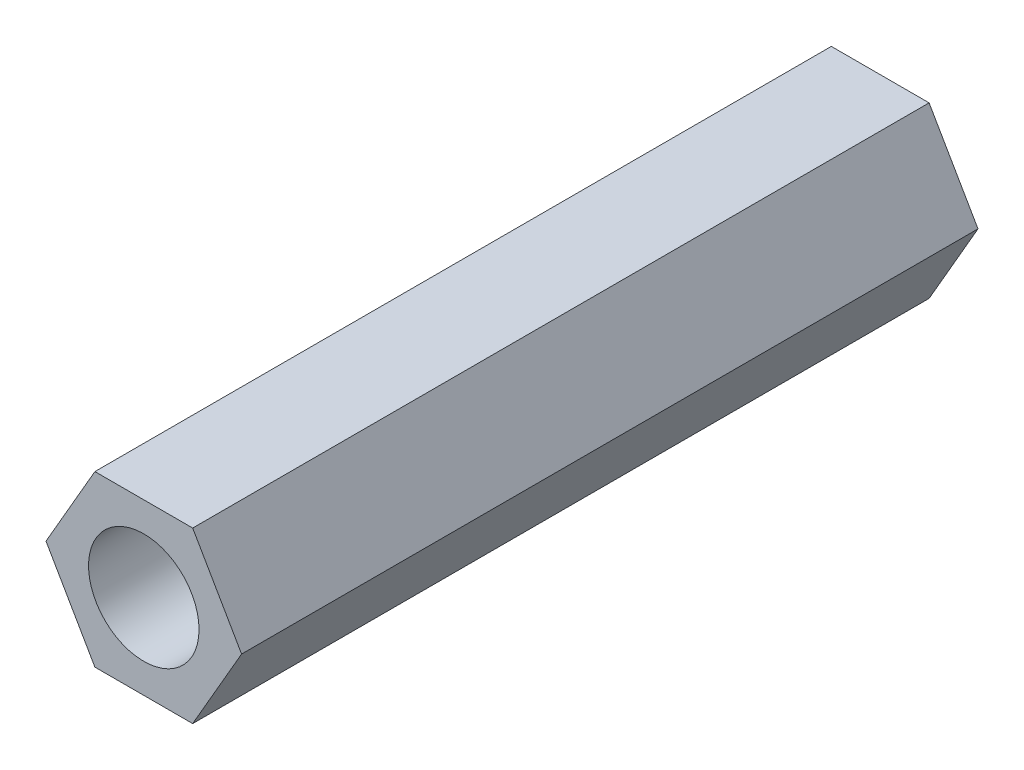
ISO-10303-21;
HEADER;
FILE_DESCRIPTION(('STEP AP214'),'2;1');
FILE_NAME('part.step','',(''),(''),'','','');
FILE_SCHEMA(('AUTOMOTIVE_DESIGN { 1 0 10303 214 1 1 1 1 }'));
ENDSEC;
DATA;
#1=APPLICATION_CONTEXT('core data for automotive mechanical design processes');
#2=APPLICATION_PROTOCOL_DEFINITION('international standard','automotive_design',2000,#1);
#3=PRODUCT_CONTEXT('',#1,'mechanical');
#4=PRODUCT('Part','Part','',(#3));
#5=PRODUCT_RELATED_PRODUCT_CATEGORY('part','',(#4));
#6=PRODUCT_DEFINITION_FORMATION('','',#4);
#7=PRODUCT_DEFINITION_CONTEXT('part definition',#1,'design');
#8=PRODUCT_DEFINITION('design','',#6,#7);
#9=PRODUCT_DEFINITION_SHAPE('','',#8);
#10=(LENGTH_UNIT() NAMED_UNIT(*) SI_UNIT(.MILLI.,.METRE.));
#11=(NAMED_UNIT(*) PLANE_ANGLE_UNIT() SI_UNIT($,.RADIAN.));
#12=(NAMED_UNIT(*) SI_UNIT($,.STERADIAN.) SOLID_ANGLE_UNIT());
#13=UNCERTAINTY_MEASURE_WITH_UNIT(LENGTH_MEASURE(1.E-05),#10,'distance_accuracy_value','');
#14=(GEOMETRIC_REPRESENTATION_CONTEXT(3) GLOBAL_UNCERTAINTY_ASSIGNED_CONTEXT((#13)) GLOBAL_UNIT_ASSIGNED_CONTEXT((#10,
#11,#12)) REPRESENTATION_CONTEXT('',''));
#15=CARTESIAN_POINT('',(0.,0.,0.));
#16=DIRECTION('',(0.,0.,1.));
#17=DIRECTION('',(1.,0.,0.));
#18=AXIS2_PLACEMENT_3D('',#15,#16,#17);
#19=CARTESIAN_POINT('',(0.,0.,20.));
#20=DIRECTION('',(0.,0.,1.));
#21=DIRECTION('',(1.,0.,0.));
#22=AXIS2_PLACEMENT_3D('',#19,#20,#21);
#23=PLANE('',#22);
#24=DIRECTION('',(0.5,0.866025403784439,0.));
#25=VECTOR('',#24,1.);
#26=CARTESIAN_POINT('',(1.32790561913614,-2.3,20.));
#27=LINE('',#26,#25);
#28=CARTESIAN_POINT('',(1.32790561913614,-2.3,20.));
#29=VERTEX_POINT('',#28);
#30=CARTESIAN_POINT('',(2.65581123827228,0.,20.));
#31=VERTEX_POINT('',#30);
#32=EDGE_CURVE('E146',#29,#31,#27,.T.);
#33=ORIENTED_EDGE('',*,*,#32,.T.);
#34=DIRECTION('',(-0.5,0.866025403784439,0.));
#35=VECTOR('',#34,1.);
#36=CARTESIAN_POINT('',(2.65581123827228,0.,20.));
#37=LINE('',#36,#35);
#38=CARTESIAN_POINT('',(1.32790561913614,2.3,20.));
#39=VERTEX_POINT('',#38);
#40=EDGE_CURVE('E94',#31,#39,#37,.T.);
#41=ORIENTED_EDGE('',*,*,#40,.T.);
#42=DIRECTION('',(-1.,0.,0.));
#43=VECTOR('',#42,1.);
#44=CARTESIAN_POINT('',(1.32790561913614,2.3,20.));
#45=LINE('',#44,#43);
#46=CARTESIAN_POINT('',(-1.32790561913614,2.3,20.));
#47=VERTEX_POINT('',#46);
#48=EDGE_CURVE('E107',#39,#47,#45,.T.);
#49=ORIENTED_EDGE('',*,*,#48,.T.);
#50=DIRECTION('',(-0.5,-0.866025403784439,0.));
#51=VECTOR('',#50,1.);
#52=CARTESIAN_POINT('',(-1.32790561913614,2.3,20.));
#53=LINE('',#52,#51);
#54=CARTESIAN_POINT('',(-2.65581123827228,0.,20.));
#55=VERTEX_POINT('',#54);
#56=EDGE_CURVE('E101',#47,#55,#53,.T.);
#57=ORIENTED_EDGE('',*,*,#56,.T.);
#58=DIRECTION('',(0.5,-0.866025403784439,0.));
#59=VECTOR('',#58,1.);
#60=CARTESIAN_POINT('',(-2.65581123827228,0.,20.));
#61=LINE('',#60,#59);
#62=CARTESIAN_POINT('',(-1.32790561913614,-2.3,20.));
#63=VERTEX_POINT('',#62);
#64=EDGE_CURVE('E105',#55,#63,#61,.T.);
#65=ORIENTED_EDGE('',*,*,#64,.T.);
#66=DIRECTION('',(1.,0.,0.));
#67=VECTOR('',#66,1.);
#68=CARTESIAN_POINT('',(-1.32790561913614,-2.3,20.));
#69=LINE('',#68,#67);
#70=EDGE_CURVE('E57',#63,#29,#69,.T.);
#71=ORIENTED_EDGE('',*,*,#70,.T.);
#72=EDGE_LOOP('',(#33,#41,#49,#57,#65,#71));
#73=FACE_BOUND('',#72,.T.);
#74=CARTESIAN_POINT('',(0.,0.,20.));
#75=DIRECTION('',(0.,0.,1.));
#76=DIRECTION('',(1.,0.,0.));
#77=AXIS2_PLACEMENT_3D('',#74,#75,#76);
#78=CIRCLE('',#77,1.5);
#79=CARTESIAN_POINT('',(1.5,0.,20.));
#80=VERTEX_POINT('',#79);
#81=EDGE_CURVE('E134',#80,#80,#78,.T.);
#82=ORIENTED_EDGE('',*,*,#81,.F.);
#83=EDGE_LOOP('',(#82));
#84=FACE_BOUND('',#83,.T.);
#85=ADVANCED_FACE('F39',(#73,#84),#23,.T.);
#86=CARTESIAN_POINT('',(0.,0.,0.));
#87=DIRECTION('',(0.,0.,1.));
#88=DIRECTION('',(1.,0.,0.));
#89=AXIS2_PLACEMENT_3D('',#86,#87,#88);
#90=PLANE('',#89);
#91=DIRECTION('',(0.5,0.866025403784439,0.));
#92=VECTOR('',#91,1.);
#93=CARTESIAN_POINT('',(1.32790561913614,-2.3,0.));
#94=LINE('',#93,#92);
#95=CARTESIAN_POINT('',(1.32790561913614,-2.3,0.));
#96=VERTEX_POINT('',#95);
#97=CARTESIAN_POINT('',(2.65581123827228,0.,0.));
#98=VERTEX_POINT('',#97);
#99=EDGE_CURVE('E129',#96,#98,#94,.T.);
#100=ORIENTED_EDGE('',*,*,#99,.F.);
#101=DIRECTION('',(1.,0.,0.));
#102=VECTOR('',#101,1.);
#103=CARTESIAN_POINT('',(-1.32790561913614,-2.3,0.));
#104=LINE('',#103,#102);
#105=CARTESIAN_POINT('',(-1.32790561913614,-2.3,0.));
#106=VERTEX_POINT('',#105);
#107=EDGE_CURVE('E86',#106,#96,#104,.T.);
#108=ORIENTED_EDGE('',*,*,#107,.F.);
#109=DIRECTION('',(0.5,-0.866025403784439,0.));
#110=VECTOR('',#109,1.);
#111=CARTESIAN_POINT('',(-2.65581123827228,0.,0.));
#112=LINE('',#111,#110);
#113=CARTESIAN_POINT('',(-2.65581123827228,0.,0.));
#114=VERTEX_POINT('',#113);
#115=EDGE_CURVE('E80',#114,#106,#112,.T.);
#116=ORIENTED_EDGE('',*,*,#115,.F.);
#117=DIRECTION('',(-0.5,-0.866025403784439,0.));
#118=VECTOR('',#117,1.);
#119=CARTESIAN_POINT('',(-1.32790561913614,2.3,0.));
#120=LINE('',#119,#118);
#121=CARTESIAN_POINT('',(-1.32790561913614,2.3,0.));
#122=VERTEX_POINT('',#121);
#123=EDGE_CURVE('E116',#122,#114,#120,.T.);
#124=ORIENTED_EDGE('',*,*,#123,.F.);
#125=DIRECTION('',(-1.,0.,0.));
#126=VECTOR('',#125,1.);
#127=CARTESIAN_POINT('',(1.32790561913614,2.3,0.));
#128=LINE('',#127,#126);
#129=CARTESIAN_POINT('',(1.32790561913614,2.3,0.));
#130=VERTEX_POINT('',#129);
#131=EDGE_CURVE('E137',#130,#122,#128,.T.);
#132=ORIENTED_EDGE('',*,*,#131,.F.);
#133=DIRECTION('',(-0.5,0.866025403784439,0.));
#134=VECTOR('',#133,1.);
#135=CARTESIAN_POINT('',(2.65581123827228,0.,0.));
#136=LINE('',#135,#134);
#137=EDGE_CURVE('E133',#98,#130,#136,.T.);
#138=ORIENTED_EDGE('',*,*,#137,.F.);
#139=EDGE_LOOP('',(#100,#108,#116,#124,#132,#138));
#140=FACE_BOUND('',#139,.T.);
#141=CARTESIAN_POINT('',(0.,0.,0.));
#142=DIRECTION('',(0.,0.,1.));
#143=DIRECTION('',(1.,0.,0.));
#144=AXIS2_PLACEMENT_3D('',#141,#142,#143);
#145=CIRCLE('',#144,1.5);
#146=CARTESIAN_POINT('',(1.5,0.,0.));
#147=VERTEX_POINT('',#146);
#148=EDGE_CURVE('E243',#147,#147,#145,.T.);
#149=ORIENTED_EDGE('',*,*,#148,.T.);
#150=EDGE_LOOP('',(#149));
#151=FACE_BOUND('',#150,.T.);
#152=ADVANCED_FACE('F159',(#140,#151),#90,.F.);
#153=CARTESIAN_POINT('',(1.32790561913614,-2.3,20.));
#154=DIRECTION('',(-0.866025403784439,0.5,0.));
#155=DIRECTION('',(-0.5,-0.866025403784439,0.));
#156=AXIS2_PLACEMENT_3D('',#153,#154,#155);
#157=PLANE('',#156);
#158=ORIENTED_EDGE('',*,*,#99,.T.);
#159=DIRECTION('',(0.,0.,-1.));
#160=VECTOR('',#159,1.);
#161=CARTESIAN_POINT('',(2.65581123827228,0.,20.));
#162=LINE('',#161,#160);
#163=EDGE_CURVE('E11',#31,#98,#162,.T.);
#164=ORIENTED_EDGE('',*,*,#163,.F.);
#165=ORIENTED_EDGE('',*,*,#32,.F.);
#166=DIRECTION('',(0.,0.,-1.));
#167=VECTOR('',#166,1.);
#168=CARTESIAN_POINT('',(1.32790561913614,-2.3,20.));
#169=LINE('',#168,#167);
#170=EDGE_CURVE('E125',#29,#96,#169,.T.);
#171=ORIENTED_EDGE('',*,*,#170,.T.);
#172=EDGE_LOOP('',(#158,#164,#165,#171));
#173=FACE_BOUND('',#172,.T.);
#174=ADVANCED_FACE('F41',(#173),#157,.F.);
#175=CARTESIAN_POINT('',(2.65581123827228,0.,20.));
#176=DIRECTION('',(-0.866025403784438,-0.5,0.));
#177=DIRECTION('',(0.5,-0.866025403784439,0.));
#178=AXIS2_PLACEMENT_3D('',#175,#176,#177);
#179=PLANE('',#178);
#180=ORIENTED_EDGE('',*,*,#137,.T.);
#181=DIRECTION('',(0.,0.,-1.));
#182=VECTOR('',#181,1.);
#183=CARTESIAN_POINT('',(1.32790561913614,2.3,20.));
#184=LINE('',#183,#182);
#185=EDGE_CURVE('E49',#39,#130,#184,.T.);
#186=ORIENTED_EDGE('',*,*,#185,.F.);
#187=ORIENTED_EDGE('',*,*,#40,.F.);
#188=ORIENTED_EDGE('',*,*,#163,.T.);
#189=EDGE_LOOP('',(#180,#186,#187,#188));
#190=FACE_BOUND('',#189,.T.);
#191=ADVANCED_FACE('F184',(#190),#179,.F.);
#192=CARTESIAN_POINT('',(1.32790561913614,2.3,20.));
#193=DIRECTION('',(0.,-1.,0.));
#194=DIRECTION('',(0.,0.,-1.));
#195=AXIS2_PLACEMENT_3D('',#192,#193,#194);
#196=PLANE('',#195);
#197=ORIENTED_EDGE('',*,*,#131,.T.);
#198=DIRECTION('',(0.,0.,-1.));
#199=VECTOR('',#198,1.);
#200=CARTESIAN_POINT('',(-1.32790561913614,2.3,20.));
#201=LINE('',#200,#199);
#202=EDGE_CURVE('E118',#47,#122,#201,.T.);
#203=ORIENTED_EDGE('',*,*,#202,.F.);
#204=ORIENTED_EDGE('',*,*,#48,.F.);
#205=ORIENTED_EDGE('',*,*,#185,.T.);
#206=EDGE_LOOP('',(#197,#203,#204,#205));
#207=FACE_BOUND('',#206,.T.);
#208=ADVANCED_FACE('F156',(#207),#196,.F.);
#209=CARTESIAN_POINT('',(-1.32790561913614,2.3,20.));
#210=DIRECTION('',(0.866025403784439,-0.5,0.));
#211=DIRECTION('',(0.5,0.866025403784439,0.));
#212=AXIS2_PLACEMENT_3D('',#209,#210,#211);
#213=PLANE('',#212);
#214=ORIENTED_EDGE('',*,*,#123,.T.);
#215=DIRECTION('',(0.,0.,-1.));
#216=VECTOR('',#215,1.);
#217=CARTESIAN_POINT('',(-2.65581123827228,0.,20.));
#218=LINE('',#217,#216);
#219=EDGE_CURVE('E113',#55,#114,#218,.T.);
#220=ORIENTED_EDGE('',*,*,#219,.F.);
#221=ORIENTED_EDGE('',*,*,#56,.F.);
#222=ORIENTED_EDGE('',*,*,#202,.T.);
#223=EDGE_LOOP('',(#214,#220,#221,#222));
#224=FACE_BOUND('',#223,.T.);
#225=ADVANCED_FACE('F114',(#224),#213,.F.);
#226=CARTESIAN_POINT('',(-2.65581123827228,0.,20.));
#227=DIRECTION('',(0.866025403784438,0.5,0.));
#228=DIRECTION('',(-0.5,0.866025403784439,0.));
#229=AXIS2_PLACEMENT_3D('',#226,#227,#228);
#230=PLANE('',#229);
#231=ORIENTED_EDGE('',*,*,#115,.T.);
#232=DIRECTION('',(0.,0.,-1.));
#233=VECTOR('',#232,1.);
#234=CARTESIAN_POINT('',(-1.32790561913614,-2.3,20.));
#235=LINE('',#234,#233);
#236=EDGE_CURVE('E119',#63,#106,#235,.T.);
#237=ORIENTED_EDGE('',*,*,#236,.F.);
#238=ORIENTED_EDGE('',*,*,#64,.F.);
#239=ORIENTED_EDGE('',*,*,#219,.T.);
#240=EDGE_LOOP('',(#231,#237,#238,#239));
#241=FACE_BOUND('',#240,.T.);
#242=ADVANCED_FACE('F121',(#241),#230,.F.);
#243=CARTESIAN_POINT('',(-1.32790561913614,-2.3,20.));
#244=DIRECTION('',(0.,1.,0.));
#245=DIRECTION('',(-1.,0.,0.));
#246=AXIS2_PLACEMENT_3D('',#243,#244,#245);
#247=PLANE('',#246);
#248=ORIENTED_EDGE('',*,*,#107,.T.);
#249=ORIENTED_EDGE('',*,*,#170,.F.);
#250=ORIENTED_EDGE('',*,*,#70,.F.);
#251=ORIENTED_EDGE('',*,*,#236,.T.);
#252=EDGE_LOOP('',(#248,#249,#250,#251));
#253=FACE_BOUND('',#252,.T.);
#254=ADVANCED_FACE('F164',(#253),#247,.F.);
#255=CARTESIAN_POINT('',(0.,0.,20.));
#256=DIRECTION('',(0.,0.,-1.));
#257=DIRECTION('',(-1.,0.,0.));
#258=AXIS2_PLACEMENT_3D('',#255,#256,#257);
#259=CYLINDRICAL_SURFACE('',#258,1.5);
#260=ORIENTED_EDGE('',*,*,#81,.T.);
#261=EDGE_LOOP('',(#260));
#262=FACE_BOUND('',#261,.T.);
#263=ORIENTED_EDGE('',*,*,#148,.F.);
#264=EDGE_LOOP('',(#263));
#265=FACE_BOUND('',#264,.T.);
#266=ADVANCED_FACE('F166',(#262,#265),#259,.F.);
#267=CLOSED_SHELL('',(#85,#152,#174,#191,#208,#225,#242,#254,#266));
#268=MANIFOLD_SOLID_BREP('B2',#267);
#269=ADVANCED_BREP_SHAPE_REPRESENTATION('',(#18,#268),#14);
#270=SHAPE_DEFINITION_REPRESENTATION(#9,#269);
ENDSEC;
END-ISO-10303-21;
